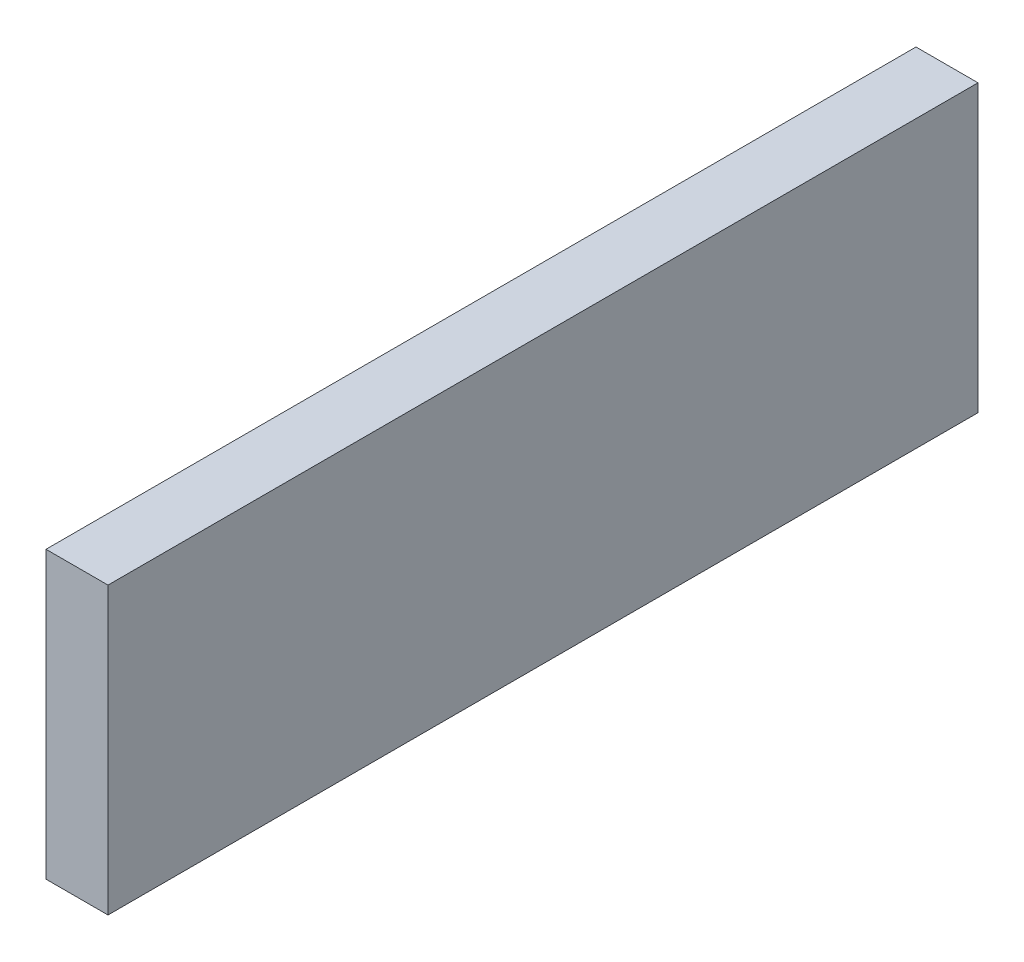
ISO-10303-21;
HEADER;
FILE_DESCRIPTION(('STEP AP214'),'2;1');
FILE_NAME('part.step','',(''),(''),'','','');
FILE_SCHEMA(('AUTOMOTIVE_DESIGN { 1 0 10303 214 1 1 1 1 }'));
ENDSEC;
DATA;
#1=APPLICATION_CONTEXT('core data for automotive mechanical design processes');
#2=APPLICATION_PROTOCOL_DEFINITION('international standard','automotive_design',2000,#1);
#3=PRODUCT_CONTEXT('',#1,'mechanical');
#4=PRODUCT('Part','Part','',(#3));
#5=PRODUCT_RELATED_PRODUCT_CATEGORY('part','',(#4));
#6=PRODUCT_DEFINITION_FORMATION('','',#4);
#7=PRODUCT_DEFINITION_CONTEXT('part definition',#1,'design');
#8=PRODUCT_DEFINITION('design','',#6,#7);
#9=PRODUCT_DEFINITION_SHAPE('','',#8);
#10=(LENGTH_UNIT() NAMED_UNIT(*) SI_UNIT(.MILLI.,.METRE.));
#11=(NAMED_UNIT(*) PLANE_ANGLE_UNIT() SI_UNIT($,.RADIAN.));
#12=(NAMED_UNIT(*) SI_UNIT($,.STERADIAN.) SOLID_ANGLE_UNIT());
#13=UNCERTAINTY_MEASURE_WITH_UNIT(LENGTH_MEASURE(1.E-05),#10,'distance_accuracy_value','');
#14=(GEOMETRIC_REPRESENTATION_CONTEXT(3) GLOBAL_UNCERTAINTY_ASSIGNED_CONTEXT((#13)) GLOBAL_UNIT_ASSIGNED_CONTEXT((#10,
#11,#12)) REPRESENTATION_CONTEXT('',''));
#15=CARTESIAN_POINT('',(0.,0.,0.));
#16=DIRECTION('',(0.,0.,1.));
#17=DIRECTION('',(1.,0.,0.));
#18=AXIS2_PLACEMENT_3D('',#15,#16,#17);
#19=CARTESIAN_POINT('',(0.24949404,1.14949224,0.));
#20=DIRECTION('',(1.,0.,0.));
#21=DIRECTION('',(0.,0.,-1.));
#22=AXIS2_PLACEMENT_3D('',#19,#20,#21);
#23=PLANE('',#22);
#24=DIRECTION('',(0.,0.,-1.));
#25=VECTOR('',#24,1.);
#26=CARTESIAN_POINT('',(0.24949404,-1.14949224,0.));
#27=LINE('',#26,#25);
#28=CARTESIAN_POINT('',(0.24949404,-1.14949224,0.));
#29=VERTEX_POINT('',#28);
#30=CARTESIAN_POINT('',(0.24949404,-1.14949224,7.));
#31=VERTEX_POINT('',#30);
#32=EDGE_CURVE('E20',#29,#31,#27,.F.);
#33=ORIENTED_EDGE('',*,*,#32,.F.);
#34=DIRECTION('',(0.,1.,0.));
#35=VECTOR('',#34,1.);
#36=CARTESIAN_POINT('',(0.24949404,-1.14949224,0.));
#37=LINE('',#36,#35);
#38=CARTESIAN_POINT('',(0.24949404,1.14949224,0.));
#39=VERTEX_POINT('',#38);
#40=EDGE_CURVE('E79',#29,#39,#37,.T.);
#41=ORIENTED_EDGE('',*,*,#40,.T.);
#42=DIRECTION('',(0.,0.,1.));
#43=VECTOR('',#42,1.);
#44=CARTESIAN_POINT('',(0.24949404,1.14949224,0.));
#45=LINE('',#44,#43);
#46=CARTESIAN_POINT('',(0.24949404,1.14949224,7.));
#47=VERTEX_POINT('',#46);
#48=EDGE_CURVE('E61',#47,#39,#45,.F.);
#49=ORIENTED_EDGE('',*,*,#48,.F.);
#50=DIRECTION('',(0.,1.,0.));
#51=VECTOR('',#50,1.);
#52=CARTESIAN_POINT('',(0.24949404,-1.14949224,7.));
#53=LINE('',#52,#51);
#54=EDGE_CURVE('E56',#31,#47,#53,.T.);
#55=ORIENTED_EDGE('',*,*,#54,.F.);
#56=EDGE_LOOP('',(#33,#41,#49,#55));
#57=FACE_BOUND('',#56,.T.);
#58=ADVANCED_FACE('F17',(#57),#23,.T.);
#59=CARTESIAN_POINT('',(0.24949404,-1.14949224,0.));
#60=DIRECTION('',(0.,-1.,0.));
#61=DIRECTION('',(0.,0.,-1.));
#62=AXIS2_PLACEMENT_3D('',#59,#60,#61);
#63=PLANE('',#62);
#64=DIRECTION('',(0.,0.,1.));
#65=VECTOR('',#64,1.);
#66=CARTESIAN_POINT('',(-0.2494915,-1.14949224,0.));
#67=LINE('',#66,#65);
#68=CARTESIAN_POINT('',(-0.2494915,-1.14949224,0.));
#69=VERTEX_POINT('',#68);
#70=CARTESIAN_POINT('',(-0.2494915,-1.14949224,7.));
#71=VERTEX_POINT('',#70);
#72=EDGE_CURVE('E83',#69,#71,#67,.T.);
#73=ORIENTED_EDGE('',*,*,#72,.F.);
#74=DIRECTION('',(1.,0.,0.));
#75=VECTOR('',#74,1.);
#76=CARTESIAN_POINT('',(0.24949404,-1.14949224,0.));
#77=LINE('',#76,#75);
#78=EDGE_CURVE('E68',#69,#29,#77,.T.);
#79=ORIENTED_EDGE('',*,*,#78,.T.);
#80=ORIENTED_EDGE('',*,*,#32,.T.);
#81=DIRECTION('',(1.,0.,0.));
#82=VECTOR('',#81,1.);
#83=CARTESIAN_POINT('',(0.24949404,-1.14949224,7.));
#84=LINE('',#83,#82);
#85=EDGE_CURVE('E63',#71,#31,#84,.T.);
#86=ORIENTED_EDGE('',*,*,#85,.F.);
#87=EDGE_LOOP('',(#73,#79,#80,#86));
#88=FACE_BOUND('',#87,.T.);
#89=ADVANCED_FACE('F65',(#88),#63,.T.);
#90=CARTESIAN_POINT('',(0.24949404,-1.14949224,7.));
#91=DIRECTION('',(0.,0.,1.));
#92=DIRECTION('',(1.,0.,0.));
#93=AXIS2_PLACEMENT_3D('',#90,#91,#92);
#94=PLANE('',#93);
#95=DIRECTION('',(0.,1.,0.));
#96=VECTOR('',#95,1.);
#97=CARTESIAN_POINT('',(-0.2494915,-1.14949224,7.));
#98=LINE('',#97,#96);
#99=CARTESIAN_POINT('',(-0.2494915,1.14949224,7.));
#100=VERTEX_POINT('',#99);
#101=EDGE_CURVE('E72',#71,#100,#98,.T.);
#102=ORIENTED_EDGE('',*,*,#101,.F.);
#103=ORIENTED_EDGE('',*,*,#85,.T.);
#104=ORIENTED_EDGE('',*,*,#54,.T.);
#105=DIRECTION('',(1.,0.,0.));
#106=VECTOR('',#105,1.);
#107=CARTESIAN_POINT('',(-0.2494915,1.14949224,7.));
#108=LINE('',#107,#106);
#109=EDGE_CURVE('E74',#100,#47,#108,.T.);
#110=ORIENTED_EDGE('',*,*,#109,.F.);
#111=EDGE_LOOP('',(#102,#103,#104,#110));
#112=FACE_BOUND('',#111,.T.);
#113=ADVANCED_FACE('F70',(#112),#94,.T.);
#114=CARTESIAN_POINT('',(-0.2494915,1.14949224,0.));
#115=DIRECTION('',(0.,1.,0.));
#116=DIRECTION('',(0.,0.,1.));
#117=AXIS2_PLACEMENT_3D('',#114,#115,#116);
#118=PLANE('',#117);
#119=ORIENTED_EDGE('',*,*,#48,.T.);
#120=DIRECTION('',(1.,0.,0.));
#121=VECTOR('',#120,1.);
#122=CARTESIAN_POINT('',(0.24949404,1.14949224,0.));
#123=LINE('',#122,#121);
#124=CARTESIAN_POINT('',(-0.2494915,1.14949224,0.));
#125=VERTEX_POINT('',#124);
#126=EDGE_CURVE('E35',#39,#125,#123,.F.);
#127=ORIENTED_EDGE('',*,*,#126,.T.);
#128=DIRECTION('',(0.,0.,1.));
#129=VECTOR('',#128,1.);
#130=CARTESIAN_POINT('',(-0.2494915,1.14949224,0.));
#131=LINE('',#130,#129);
#132=EDGE_CURVE('E26',#100,#125,#131,.F.);
#133=ORIENTED_EDGE('',*,*,#132,.F.);
#134=ORIENTED_EDGE('',*,*,#109,.T.);
#135=EDGE_LOOP('',(#119,#127,#133,#134));
#136=FACE_BOUND('',#135,.T.);
#137=ADVANCED_FACE('F89',(#136),#118,.T.);
#138=CARTESIAN_POINT('',(0.24949404,-1.14949224,0.));
#139=DIRECTION('',(0.,0.,1.));
#140=DIRECTION('',(1.,0.,0.));
#141=AXIS2_PLACEMENT_3D('',#138,#139,#140);
#142=PLANE('',#141);
#143=DIRECTION('',(0.,1.,0.));
#144=VECTOR('',#143,1.);
#145=CARTESIAN_POINT('',(-0.2494915,-1.14949224,0.));
#146=LINE('',#145,#144);
#147=EDGE_CURVE('E11',#125,#69,#146,.F.);
#148=ORIENTED_EDGE('',*,*,#147,.F.);
#149=ORIENTED_EDGE('',*,*,#126,.F.);
#150=ORIENTED_EDGE('',*,*,#40,.F.);
#151=ORIENTED_EDGE('',*,*,#78,.F.);
#152=EDGE_LOOP('',(#148,#149,#150,#151));
#153=FACE_BOUND('',#152,.T.);
#154=ADVANCED_FACE('F91',(#153),#142,.F.);
#155=CARTESIAN_POINT('',(-0.2494915,-1.14949224,0.));
#156=DIRECTION('',(-1.,0.,0.));
#157=DIRECTION('',(0.,0.,1.));
#158=AXIS2_PLACEMENT_3D('',#155,#156,#157);
#159=PLANE('',#158);
#160=ORIENTED_EDGE('',*,*,#132,.T.);
#161=ORIENTED_EDGE('',*,*,#147,.T.);
#162=ORIENTED_EDGE('',*,*,#72,.T.);
#163=ORIENTED_EDGE('',*,*,#101,.T.);
#164=EDGE_LOOP('',(#160,#161,#162,#163));
#165=FACE_BOUND('',#164,.T.);
#166=ADVANCED_FACE('F88',(#165),#159,.T.);
#167=CLOSED_SHELL('',(#58,#89,#113,#137,#154,#166));
#168=MANIFOLD_SOLID_BREP('B1',#167);
#169=ADVANCED_BREP_SHAPE_REPRESENTATION('',(#18,#168),#14);
#170=SHAPE_DEFINITION_REPRESENTATION(#9,#169);
ENDSEC;
END-ISO-10303-21;
